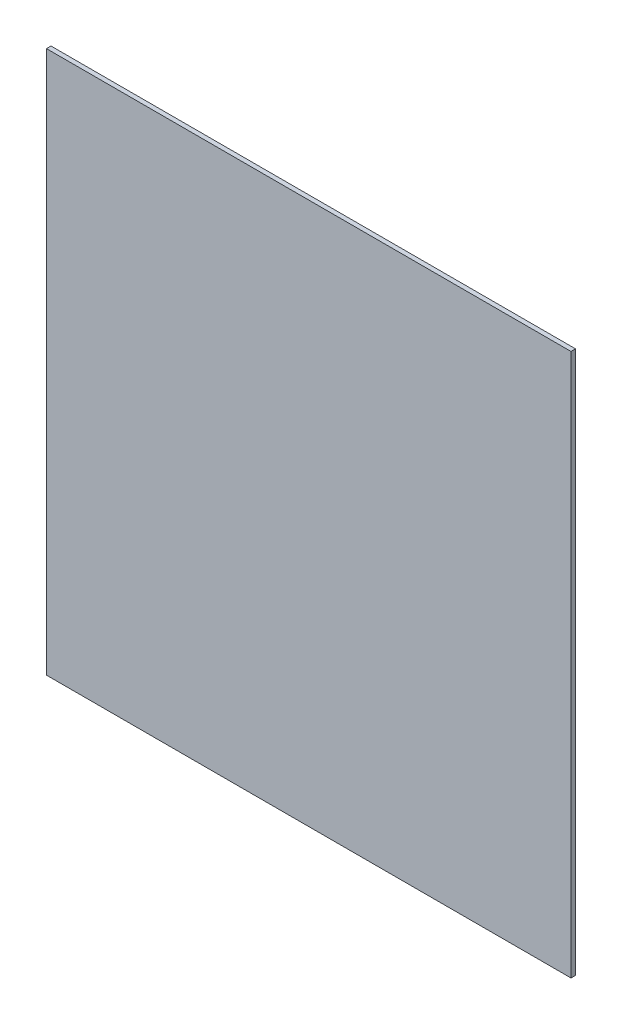
ISO-10303-21;
HEADER;
FILE_DESCRIPTION(('STEP AP214'),'2;1');
FILE_NAME('part.step','',(''),(''),'','','');
FILE_SCHEMA(('AUTOMOTIVE_DESIGN { 1 0 10303 214 1 1 1 1 }'));
ENDSEC;
DATA;
#1=APPLICATION_CONTEXT('core data for automotive mechanical design processes');
#2=APPLICATION_PROTOCOL_DEFINITION('international standard','automotive_design',2000,#1);
#3=PRODUCT_CONTEXT('',#1,'mechanical');
#4=PRODUCT('Part','Part','',(#3));
#5=PRODUCT_RELATED_PRODUCT_CATEGORY('part','',(#4));
#6=PRODUCT_DEFINITION_FORMATION('','',#4);
#7=PRODUCT_DEFINITION_CONTEXT('part definition',#1,'design');
#8=PRODUCT_DEFINITION('design','',#6,#7);
#9=PRODUCT_DEFINITION_SHAPE('','',#8);
#10=(LENGTH_UNIT() NAMED_UNIT(*) SI_UNIT(.MILLI.,.METRE.));
#11=(NAMED_UNIT(*) PLANE_ANGLE_UNIT() SI_UNIT($,.RADIAN.));
#12=(NAMED_UNIT(*) SI_UNIT($,.STERADIAN.) SOLID_ANGLE_UNIT());
#13=UNCERTAINTY_MEASURE_WITH_UNIT(LENGTH_MEASURE(1.E-05),#10,'distance_accuracy_value','');
#14=(GEOMETRIC_REPRESENTATION_CONTEXT(3) GLOBAL_UNCERTAINTY_ASSIGNED_CONTEXT((#13)) GLOBAL_UNIT_ASSIGNED_CONTEXT((#10,
#11,#12)) REPRESENTATION_CONTEXT('',''));
#15=CARTESIAN_POINT('',(0.,0.,0.));
#16=DIRECTION('',(0.,0.,1.));
#17=DIRECTION('',(1.,0.,0.));
#18=AXIS2_PLACEMENT_3D('',#15,#16,#17);
#19=CARTESIAN_POINT('',(290.,300.,5.));
#20=DIRECTION('',(-1.,0.,0.));
#21=DIRECTION('',(0.,-1.,0.));
#22=AXIS2_PLACEMENT_3D('',#19,#20,#21);
#23=PLANE('',#22);
#24=DIRECTION('',(0.,1.,0.));
#25=VECTOR('',#24,1.);
#26=CARTESIAN_POINT('',(290.,300.,0.));
#27=LINE('',#26,#25);
#28=CARTESIAN_POINT('',(290.,-300.,0.));
#29=VERTEX_POINT('',#28);
#30=CARTESIAN_POINT('',(290.,300.,0.));
#31=VERTEX_POINT('',#30);
#32=EDGE_CURVE('E102',#29,#31,#27,.T.);
#33=ORIENTED_EDGE('',*,*,#32,.T.);
#34=DIRECTION('',(0.,0.,-1.));
#35=VECTOR('',#34,1.);
#36=CARTESIAN_POINT('',(290.,300.,5.));
#37=LINE('',#36,#35);
#38=CARTESIAN_POINT('',(290.,300.,5.));
#39=VERTEX_POINT('',#38);
#40=EDGE_CURVE('E11',#39,#31,#37,.T.);
#41=ORIENTED_EDGE('',*,*,#40,.F.);
#42=DIRECTION('',(0.,1.,0.));
#43=VECTOR('',#42,1.);
#44=CARTESIAN_POINT('',(290.,300.,5.));
#45=LINE('',#44,#43);
#46=CARTESIAN_POINT('',(290.,-300.,5.));
#47=VERTEX_POINT('',#46);
#48=EDGE_CURVE('E90',#47,#39,#45,.T.);
#49=ORIENTED_EDGE('',*,*,#48,.F.);
#50=DIRECTION('',(0.,0.,-1.));
#51=VECTOR('',#50,1.);
#52=CARTESIAN_POINT('',(290.,-300.,5.));
#53=LINE('',#52,#51);
#54=EDGE_CURVE('E98',#47,#29,#53,.T.);
#55=ORIENTED_EDGE('',*,*,#54,.T.);
#56=EDGE_LOOP('',(#33,#41,#49,#55));
#57=FACE_BOUND('',#56,.T.);
#58=ADVANCED_FACE('F39',(#57),#23,.F.);
#59=CARTESIAN_POINT('',(-290.,300.,5.));
#60=DIRECTION('',(0.,-1.,0.));
#61=DIRECTION('',(0.,0.,-1.));
#62=AXIS2_PLACEMENT_3D('',#59,#60,#61);
#63=PLANE('',#62);
#64=DIRECTION('',(-1.,0.,0.));
#65=VECTOR('',#64,1.);
#66=CARTESIAN_POINT('',(-290.,300.,0.));
#67=LINE('',#66,#65);
#68=CARTESIAN_POINT('',(-290.,300.,0.));
#69=VERTEX_POINT('',#68);
#70=EDGE_CURVE('E94',#31,#69,#67,.T.);
#71=ORIENTED_EDGE('',*,*,#70,.T.);
#72=DIRECTION('',(0.,0.,-1.));
#73=VECTOR('',#72,1.);
#74=CARTESIAN_POINT('',(-290.,300.,5.));
#75=LINE('',#74,#73);
#76=CARTESIAN_POINT('',(-290.,300.,5.));
#77=VERTEX_POINT('',#76);
#78=EDGE_CURVE('E47',#77,#69,#75,.T.);
#79=ORIENTED_EDGE('',*,*,#78,.F.);
#80=DIRECTION('',(-1.,0.,0.));
#81=VECTOR('',#80,1.);
#82=CARTESIAN_POINT('',(-290.,300.,5.));
#83=LINE('',#82,#81);
#84=EDGE_CURVE('E85',#39,#77,#83,.T.);
#85=ORIENTED_EDGE('',*,*,#84,.F.);
#86=ORIENTED_EDGE('',*,*,#40,.T.);
#87=EDGE_LOOP('',(#71,#79,#85,#86));
#88=FACE_BOUND('',#87,.T.);
#89=ADVANCED_FACE('F93',(#88),#63,.F.);
#90=CARTESIAN_POINT('',(-290.,300.,5.));
#91=DIRECTION('',(1.,0.,0.));
#92=DIRECTION('',(0.,1.,0.));
#93=AXIS2_PLACEMENT_3D('',#90,#91,#92);
#94=PLANE('',#93);
#95=DIRECTION('',(0.,-1.,0.));
#96=VECTOR('',#95,1.);
#97=CARTESIAN_POINT('',(-290.,300.,0.));
#98=LINE('',#97,#96);
#99=CARTESIAN_POINT('',(-290.,-300.,0.));
#100=VERTEX_POINT('',#99);
#101=EDGE_CURVE('E72',#69,#100,#98,.T.);
#102=ORIENTED_EDGE('',*,*,#101,.T.);
#103=DIRECTION('',(0.,0.,-1.));
#104=VECTOR('',#103,1.);
#105=CARTESIAN_POINT('',(-290.,-300.,5.));
#106=LINE('',#105,#104);
#107=CARTESIAN_POINT('',(-290.,-300.,5.));
#108=VERTEX_POINT('',#107);
#109=EDGE_CURVE('E95',#108,#100,#106,.T.);
#110=ORIENTED_EDGE('',*,*,#109,.F.);
#111=DIRECTION('',(0.,-1.,0.));
#112=VECTOR('',#111,1.);
#113=CARTESIAN_POINT('',(-290.,300.,5.));
#114=LINE('',#113,#112);
#115=EDGE_CURVE('E88',#77,#108,#114,.T.);
#116=ORIENTED_EDGE('',*,*,#115,.F.);
#117=ORIENTED_EDGE('',*,*,#78,.T.);
#118=EDGE_LOOP('',(#102,#110,#116,#117));
#119=FACE_BOUND('',#118,.T.);
#120=ADVANCED_FACE('F96',(#119),#94,.F.);
#121=CARTESIAN_POINT('',(-290.,-300.,5.));
#122=DIRECTION('',(0.,1.,0.));
#123=DIRECTION('',(0.,0.,1.));
#124=AXIS2_PLACEMENT_3D('',#121,#122,#123);
#125=PLANE('',#124);
#126=DIRECTION('',(1.,0.,0.));
#127=VECTOR('',#126,1.);
#128=CARTESIAN_POINT('',(-290.,-300.,0.));
#129=LINE('',#128,#127);
#130=EDGE_CURVE('E78',#100,#29,#129,.T.);
#131=ORIENTED_EDGE('',*,*,#130,.T.);
#132=ORIENTED_EDGE('',*,*,#54,.F.);
#133=DIRECTION('',(1.,0.,0.));
#134=VECTOR('',#133,1.);
#135=CARTESIAN_POINT('',(-290.,-300.,5.));
#136=LINE('',#135,#134);
#137=EDGE_CURVE('E55',#108,#47,#136,.T.);
#138=ORIENTED_EDGE('',*,*,#137,.F.);
#139=ORIENTED_EDGE('',*,*,#109,.T.);
#140=EDGE_LOOP('',(#131,#132,#138,#139));
#141=FACE_BOUND('',#140,.T.);
#142=ADVANCED_FACE('F109',(#141),#125,.F.);
#143=CARTESIAN_POINT('',(0.,0.,5.));
#144=DIRECTION('',(0.,0.,1.));
#145=DIRECTION('',(1.,0.,0.));
#146=AXIS2_PLACEMENT_3D('',#143,#144,#145);
#147=PLANE('',#146);
#148=ORIENTED_EDGE('',*,*,#48,.T.);
#149=ORIENTED_EDGE('',*,*,#84,.T.);
#150=ORIENTED_EDGE('',*,*,#115,.T.);
#151=ORIENTED_EDGE('',*,*,#137,.T.);
#152=EDGE_LOOP('',(#148,#149,#150,#151));
#153=FACE_BOUND('',#152,.T.);
#154=ADVANCED_FACE('F86',(#153),#147,.T.);
#155=CARTESIAN_POINT('',(0.,0.,0.));
#156=DIRECTION('',(0.,0.,1.));
#157=DIRECTION('',(1.,0.,0.));
#158=AXIS2_PLACEMENT_3D('',#155,#156,#157);
#159=PLANE('',#158);
#160=ORIENTED_EDGE('',*,*,#32,.F.);
#161=ORIENTED_EDGE('',*,*,#130,.F.);
#162=ORIENTED_EDGE('',*,*,#101,.F.);
#163=ORIENTED_EDGE('',*,*,#70,.F.);
#164=EDGE_LOOP('',(#160,#161,#162,#163));
#165=FACE_BOUND('',#164,.T.);
#166=ADVANCED_FACE('F112',(#165),#159,.F.);
#167=CLOSED_SHELL('',(#58,#89,#120,#142,#154,#166));
#168=MANIFOLD_SOLID_BREP('B2',#167);
#169=ADVANCED_BREP_SHAPE_REPRESENTATION('',(#18,#168),#14);
#170=SHAPE_DEFINITION_REPRESENTATION(#9,#169);
ENDSEC;
END-ISO-10303-21;
